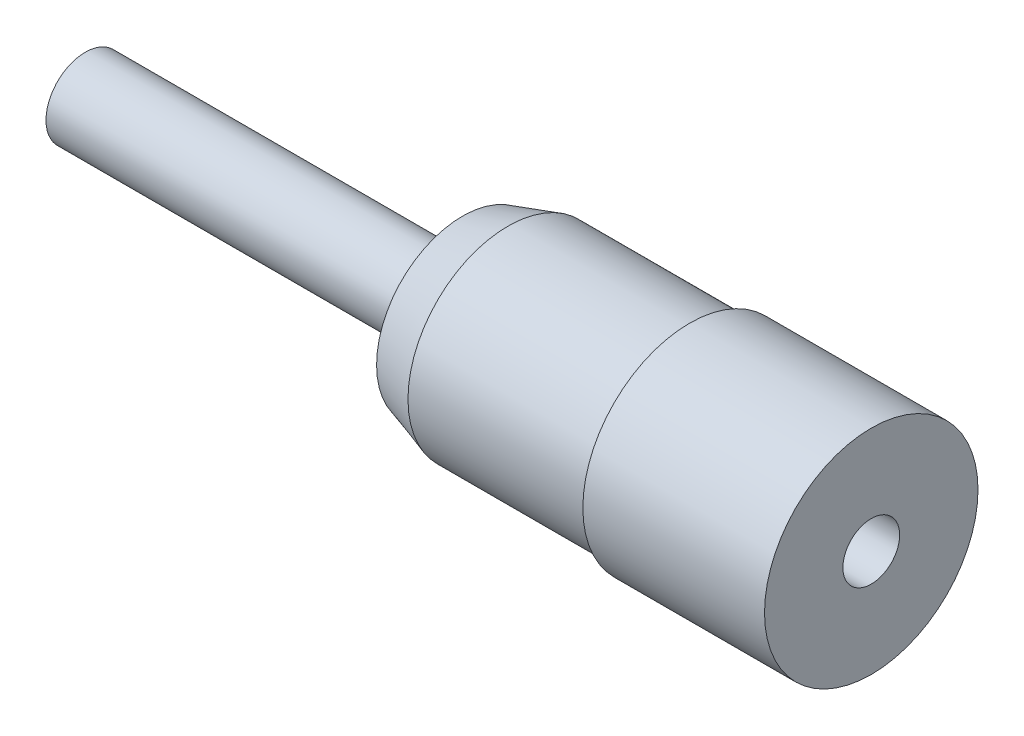
ISO-10303-21;
HEADER;
FILE_DESCRIPTION(('STEP AP214'),'2;1');
FILE_NAME('part.step','',(''),(''),'','','');
FILE_SCHEMA(('AUTOMOTIVE_DESIGN { 1 0 10303 214 1 1 1 1 }'));
ENDSEC;
DATA;
#1=APPLICATION_CONTEXT('core data for automotive mechanical design processes');
#2=APPLICATION_PROTOCOL_DEFINITION('international standard','automotive_design',2000,#1);
#3=PRODUCT_CONTEXT('',#1,'mechanical');
#4=PRODUCT('Part','Part','',(#3));
#5=PRODUCT_RELATED_PRODUCT_CATEGORY('part','',(#4));
#6=PRODUCT_DEFINITION_FORMATION('','',#4);
#7=PRODUCT_DEFINITION_CONTEXT('part definition',#1,'design');
#8=PRODUCT_DEFINITION('design','',#6,#7);
#9=PRODUCT_DEFINITION_SHAPE('','',#8);
#10=(LENGTH_UNIT() NAMED_UNIT(*) SI_UNIT(.MILLI.,.METRE.));
#11=(NAMED_UNIT(*) PLANE_ANGLE_UNIT() SI_UNIT($,.RADIAN.));
#12=(NAMED_UNIT(*) SI_UNIT($,.STERADIAN.) SOLID_ANGLE_UNIT());
#13=UNCERTAINTY_MEASURE_WITH_UNIT(LENGTH_MEASURE(1.E-05),#10,'distance_accuracy_value','');
#14=(GEOMETRIC_REPRESENTATION_CONTEXT(3) GLOBAL_UNCERTAINTY_ASSIGNED_CONTEXT((#13)) GLOBAL_UNIT_ASSIGNED_CONTEXT((#10,
#11,#12)) REPRESENTATION_CONTEXT('',''));
#15=CARTESIAN_POINT('',(0.,0.,0.));
#16=DIRECTION('',(0.,0.,1.));
#17=DIRECTION('',(1.,0.,0.));
#18=AXIS2_PLACEMENT_3D('',#15,#16,#17);
#19=CARTESIAN_POINT('',(277.446915198027,0.,0.));
#20=DIRECTION('',(-1.,0.,0.));
#21=DIRECTION('',(0.,0.,1.));
#22=AXIS2_PLACEMENT_3D('',#19,#20,#21);
#23=PLANE('',#22);
#24=CARTESIAN_POINT('',(277.446915198027,76.7068519283227,0.));
#25=DIRECTION('',(-1.,0.,0.));
#26=DIRECTION('',(0.,0.,1.));
#27=AXIS2_PLACEMENT_3D('',#24,#25,#26);
#28=CIRCLE('',#27,1.73);
#29=CARTESIAN_POINT('',(277.446915198027,76.7068519283227,1.73));
#30=VERTEX_POINT('',#29);
#31=EDGE_CURVE('E55',#30,#30,#28,.T.);
#32=ORIENTED_EDGE('',*,*,#31,.T.);
#33=EDGE_LOOP('',(#32));
#34=FACE_BOUND('',#33,.T.);
#35=ADVANCED_FACE('F36',(#34),#23,.T.);
#36=CARTESIAN_POINT('',(312.055680528163,0.,0.));
#37=DIRECTION('',(1.,0.,0.));
#38=DIRECTION('',(0.,0.,-1.));
#39=AXIS2_PLACEMENT_3D('',#36,#37,#38);
#40=PLANE('',#39);
#41=CARTESIAN_POINT('',(312.055680528163,76.7068519283227,0.));
#42=DIRECTION('',(1.,0.,0.));
#43=DIRECTION('',(0.,0.,-1.));
#44=AXIS2_PLACEMENT_3D('',#41,#42,#43);
#45=CIRCLE('',#44,1.25);
#46=CARTESIAN_POINT('',(312.055680528163,76.7068519283227,-1.25));
#47=VERTEX_POINT('',#46);
#48=EDGE_CURVE('E56',#47,#47,#45,.T.);
#49=ORIENTED_EDGE('',*,*,#48,.F.);
#50=EDGE_LOOP('',(#49));
#51=FACE_BOUND('',#50,.T.);
#52=CARTESIAN_POINT('',(312.055680528163,76.7068519283227,0.));
#53=DIRECTION('',(-1.,0.,0.));
#54=DIRECTION('',(0.,0.,1.));
#55=AXIS2_PLACEMENT_3D('',#52,#53,#54);
#56=CIRCLE('',#55,4.7);
#57=CARTESIAN_POINT('',(312.055680528163,76.7068519283227,4.7));
#58=VERTEX_POINT('',#57);
#59=EDGE_CURVE('E11',#58,#58,#56,.T.);
#60=ORIENTED_EDGE('',*,*,#59,.F.);
#61=EDGE_LOOP('',(#60));
#62=FACE_BOUND('',#61,.T.);
#63=ADVANCED_FACE('F97',(#51,#62),#40,.T.);
#64=CARTESIAN_POINT('',(277.446915198027,76.7068519283227,0.));
#65=DIRECTION('',(-1.,0.,0.));
#66=DIRECTION('',(0.,0.,1.));
#67=AXIS2_PLACEMENT_3D('',#64,#65,#66);
#68=CYLINDRICAL_SURFACE('',#67,4.70000000000001);
#69=ORIENTED_EDGE('',*,*,#59,.T.);
#70=EDGE_LOOP('',(#69));
#71=FACE_BOUND('',#70,.T.);
#72=CARTESIAN_POINT('',(304.055680528163,76.7068519283227,0.));
#73=DIRECTION('',(-1.,0.,0.));
#74=DIRECTION('',(0.,0.,1.));
#75=AXIS2_PLACEMENT_3D('',#72,#73,#74);
#76=CIRCLE('',#75,4.70000000000002);
#77=CARTESIAN_POINT('',(304.055680528163,76.7068519283227,4.70000000000002));
#78=VERTEX_POINT('',#77);
#79=EDGE_CURVE('E42',#78,#78,#76,.T.);
#80=ORIENTED_EDGE('',*,*,#79,.F.);
#81=EDGE_LOOP('',(#80));
#82=FACE_BOUND('',#81,.T.);
#83=ADVANCED_FACE('F95',(#71,#82),#68,.T.);
#84=CARTESIAN_POINT('',(303.855680528163,76.7068519283227,0.));
#85=DIRECTION('',(1.,0.,0.));
#86=DIRECTION('',(0.,0.,-1.));
#87=AXIS2_PLACEMENT_3D('',#84,#85,#86);
#88=CONICAL_SURFACE('',#87,4.4,0.982793723247414);
#89=ORIENTED_EDGE('',*,*,#79,.T.);
#90=EDGE_LOOP('',(#89));
#91=FACE_BOUND('',#90,.T.);
#92=CARTESIAN_POINT('',(303.855680528163,76.7068519283227,0.));
#93=DIRECTION('',(-1.,0.,0.));
#94=DIRECTION('',(0.,0.,1.));
#95=AXIS2_PLACEMENT_3D('',#92,#93,#94);
#96=CIRCLE('',#95,4.4);
#97=CARTESIAN_POINT('',(303.855680528163,76.7068519283227,4.4));
#98=VERTEX_POINT('',#97);
#99=EDGE_CURVE('E87',#98,#98,#96,.T.);
#100=ORIENTED_EDGE('',*,*,#99,.F.);
#101=EDGE_LOOP('',(#100));
#102=FACE_BOUND('',#101,.T.);
#103=ADVANCED_FACE('F92',(#91,#102),#88,.T.);
#104=CARTESIAN_POINT('',(277.446915198027,76.7068519283227,0.));
#105=DIRECTION('',(-1.,0.,0.));
#106=DIRECTION('',(0.,0.,1.));
#107=AXIS2_PLACEMENT_3D('',#104,#105,#106);
#108=CYLINDRICAL_SURFACE('',#107,4.4);
#109=ORIENTED_EDGE('',*,*,#99,.T.);
#110=EDGE_LOOP('',(#109));
#111=FACE_BOUND('',#110,.T.);
#112=CARTESIAN_POINT('',(296.055680528163,76.7068519283227,0.));
#113=DIRECTION('',(-1.,0.,0.));
#114=DIRECTION('',(0.,0.,1.));
#115=AXIS2_PLACEMENT_3D('',#112,#113,#114);
#116=CIRCLE('',#115,4.4);
#117=CARTESIAN_POINT('',(296.055680528163,76.7068519283227,4.4));
#118=VERTEX_POINT('',#117);
#119=EDGE_CURVE('E84',#118,#118,#116,.T.);
#120=ORIENTED_EDGE('',*,*,#119,.F.);
#121=EDGE_LOOP('',(#120));
#122=FACE_BOUND('',#121,.T.);
#123=ADVANCED_FACE('F104',(#111,#122),#108,.T.);
#124=CARTESIAN_POINT('',(296.055680528163,76.7068519283227,0.));
#125=DIRECTION('',(1.,0.,0.));
#126=DIRECTION('',(0.,0.,-1.));
#127=AXIS2_PLACEMENT_3D('',#124,#125,#126);
#128=CONICAL_SURFACE('',#127,4.4,0.29973289233041);
#129=CARTESIAN_POINT('',(294.055680528163,76.7068519283227,0.));
#130=DIRECTION('',(-1.,0.,0.));
#131=DIRECTION('',(0.,0.,1.));
#132=AXIS2_PLACEMENT_3D('',#129,#130,#131);
#133=CIRCLE('',#132,3.78191278626036);
#134=CARTESIAN_POINT('',(294.055680528163,76.7068519283227,3.78191278626036));
#135=VERTEX_POINT('',#134);
#136=EDGE_CURVE('E81',#135,#135,#133,.T.);
#137=ORIENTED_EDGE('',*,*,#136,.F.);
#138=EDGE_LOOP('',(#137));
#139=FACE_BOUND('',#138,.T.);
#140=ORIENTED_EDGE('',*,*,#119,.T.);
#141=EDGE_LOOP('',(#140));
#142=FACE_BOUND('',#141,.T.);
#143=ADVANCED_FACE('F143',(#139,#142),#128,.T.);
#144=CARTESIAN_POINT('',(294.055680528163,0.,0.));
#145=DIRECTION('',(1.,0.,0.));
#146=DIRECTION('',(0.,0.,-1.));
#147=AXIS2_PLACEMENT_3D('',#144,#145,#146);
#148=PLANE('',#147);
#149=CARTESIAN_POINT('',(294.055680528163,76.7068519283227,0.));
#150=DIRECTION('',(-1.,0.,0.));
#151=DIRECTION('',(0.,0.,1.));
#152=AXIS2_PLACEMENT_3D('',#149,#150,#151);
#153=CIRCLE('',#152,3.46791323915042);
#154=CARTESIAN_POINT('',(294.055680528163,76.7068519283227,3.46791323915042));
#155=VERTEX_POINT('',#154);
#156=EDGE_CURVE('E78',#155,#155,#153,.T.);
#157=ORIENTED_EDGE('',*,*,#156,.F.);
#158=EDGE_LOOP('',(#157));
#159=FACE_BOUND('',#158,.T.);
#160=ORIENTED_EDGE('',*,*,#136,.T.);
#161=EDGE_LOOP('',(#160));
#162=FACE_BOUND('',#161,.T.);
#163=ADVANCED_FACE('F139',(#159,#162),#148,.F.);
#164=CARTESIAN_POINT('',(296.100980113072,76.7068519283227,0.));
#165=DIRECTION('',(1.,0.,0.));
#166=DIRECTION('',(0.,0.,-1.));
#167=AXIS2_PLACEMENT_3D('',#164,#165,#166);
#168=CONICAL_SURFACE('',#167,4.10000000000001,0.299732892330405);
#169=ORIENTED_EDGE('',*,*,#156,.T.);
#170=EDGE_LOOP('',(#169));
#171=FACE_BOUND('',#170,.T.);
#172=CARTESIAN_POINT('',(296.100980113072,76.7068519283227,0.));
#173=DIRECTION('',(-1.,0.,0.));
#174=DIRECTION('',(0.,0.,1.));
#175=AXIS2_PLACEMENT_3D('',#172,#173,#174);
#176=CIRCLE('',#175,4.10000000000001);
#177=CARTESIAN_POINT('',(296.100980113072,76.7068519283227,4.10000000000001));
#178=VERTEX_POINT('',#177);
#179=EDGE_CURVE('E75',#178,#178,#176,.T.);
#180=ORIENTED_EDGE('',*,*,#179,.F.);
#181=EDGE_LOOP('',(#180));
#182=FACE_BOUND('',#181,.T.);
#183=ADVANCED_FACE('F135',(#171,#182),#168,.F.);
#184=CARTESIAN_POINT('',(277.446915198027,76.7068519283227,0.));
#185=DIRECTION('',(-1.,0.,0.));
#186=DIRECTION('',(0.,0.,1.));
#187=AXIS2_PLACEMENT_3D('',#184,#185,#186);
#188=CYLINDRICAL_SURFACE('',#187,4.10000000000001);
#189=CARTESIAN_POINT('',(304.01623565571,76.7068519283227,0.));
#190=DIRECTION('',(-1.,0.,0.));
#191=DIRECTION('',(0.,0.,1.));
#192=AXIS2_PLACEMENT_3D('',#189,#190,#191);
#193=CIRCLE('',#192,4.10000000000001);
#194=CARTESIAN_POINT('',(304.01623565571,76.7068519283227,4.10000000000001));
#195=VERTEX_POINT('',#194);
#196=EDGE_CURVE('E72',#195,#195,#193,.T.);
#197=ORIENTED_EDGE('',*,*,#196,.F.);
#198=EDGE_LOOP('',(#197));
#199=FACE_BOUND('',#198,.T.);
#200=ORIENTED_EDGE('',*,*,#179,.T.);
#201=EDGE_LOOP('',(#200));
#202=FACE_BOUND('',#201,.T.);
#203=ADVANCED_FACE('F131',(#199,#202),#188,.F.);
#204=CARTESIAN_POINT('',(304.01623565571,76.7068519283227,0.));
#205=DIRECTION('',(1.,0.,0.));
#206=DIRECTION('',(0.,0.,-1.));
#207=AXIS2_PLACEMENT_3D('',#204,#205,#206);
#208=CONICAL_SURFACE('',#207,4.10000000000001,0.982793723247372);
#209=CARTESIAN_POINT('',(304.21623565571,76.7068519283227,0.));
#210=DIRECTION('',(-1.,0.,0.));
#211=DIRECTION('',(0.,0.,1.));
#212=AXIS2_PLACEMENT_3D('',#209,#210,#211);
#213=CIRCLE('',#212,4.4);
#214=CARTESIAN_POINT('',(304.21623565571,76.7068519283227,4.4));
#215=VERTEX_POINT('',#214);
#216=EDGE_CURVE('E69',#215,#215,#213,.T.);
#217=ORIENTED_EDGE('',*,*,#216,.F.);
#218=EDGE_LOOP('',(#217));
#219=FACE_BOUND('',#218,.T.);
#220=ORIENTED_EDGE('',*,*,#196,.T.);
#221=EDGE_LOOP('',(#220));
#222=FACE_BOUND('',#221,.T.);
#223=ADVANCED_FACE('F127',(#219,#222),#208,.F.);
#224=CARTESIAN_POINT('',(277.446915198027,76.7068519283227,0.));
#225=DIRECTION('',(-1.,0.,0.));
#226=DIRECTION('',(0.,0.,1.));
#227=AXIS2_PLACEMENT_3D('',#224,#225,#226);
#228=CYLINDRICAL_SURFACE('',#227,4.40000000000001);
#229=CARTESIAN_POINT('',(309.446915198027,76.7068519283227,0.));
#230=DIRECTION('',(-1.,0.,0.));
#231=DIRECTION('',(0.,0.,1.));
#232=AXIS2_PLACEMENT_3D('',#229,#230,#231);
#233=CIRCLE('',#232,4.40000000000001);
#234=CARTESIAN_POINT('',(309.446915198027,76.7068519283227,4.40000000000001));
#235=VERTEX_POINT('',#234);
#236=EDGE_CURVE('E66',#235,#235,#233,.T.);
#237=ORIENTED_EDGE('',*,*,#236,.F.);
#238=EDGE_LOOP('',(#237));
#239=FACE_BOUND('',#238,.T.);
#240=ORIENTED_EDGE('',*,*,#216,.T.);
#241=EDGE_LOOP('',(#240));
#242=FACE_BOUND('',#241,.T.);
#243=ADVANCED_FACE('F120',(#239,#242),#228,.F.);
#244=CARTESIAN_POINT('',(309.446915198027,0.,0.));
#245=DIRECTION('',(-1.,0.,0.));
#246=DIRECTION('',(0.,0.,1.));
#247=AXIS2_PLACEMENT_3D('',#244,#245,#246);
#248=PLANE('',#247);
#249=ORIENTED_EDGE('',*,*,#236,.T.);
#250=EDGE_LOOP('',(#249));
#251=FACE_BOUND('',#250,.T.);
#252=CARTESIAN_POINT('',(309.446915198027,76.7068519283227,0.));
#253=DIRECTION('',(-1.,0.,0.));
#254=DIRECTION('',(0.,0.,1.));
#255=AXIS2_PLACEMENT_3D('',#252,#253,#254);
#256=CIRCLE('',#255,1.73);
#257=CARTESIAN_POINT('',(309.446915198027,76.7068519283227,1.73));
#258=VERTEX_POINT('',#257);
#259=EDGE_CURVE('E59',#258,#258,#256,.T.);
#260=ORIENTED_EDGE('',*,*,#259,.F.);
#261=EDGE_LOOP('',(#260));
#262=FACE_BOUND('',#261,.T.);
#263=ADVANCED_FACE('F114',(#251,#262),#248,.T.);
#264=CARTESIAN_POINT('',(277.446915198027,76.7068519283227,0.));
#265=DIRECTION('',(-1.,0.,0.));
#266=DIRECTION('',(0.,0.,1.));
#267=AXIS2_PLACEMENT_3D('',#264,#265,#266);
#268=CYLINDRICAL_SURFACE('',#267,1.73);
#269=ORIENTED_EDGE('',*,*,#259,.T.);
#270=EDGE_LOOP('',(#269));
#271=FACE_BOUND('',#270,.T.);
#272=ORIENTED_EDGE('',*,*,#31,.F.);
#273=EDGE_LOOP('',(#272));
#274=FACE_BOUND('',#273,.T.);
#275=ADVANCED_FACE('F49',(#271,#274),#268,.T.);
#276=CARTESIAN_POINT('',(306.555680528163,76.7068519283227,0.));
#277=DIRECTION('',(1.,0.,0.));
#278=DIRECTION('',(0.,0.,-1.));
#279=AXIS2_PLACEMENT_3D('',#276,#277,#278);
#280=CONICAL_SURFACE('',#279,1.25,1.02974425867668);
#281=CARTESIAN_POINT('',(305.804604754379,76.7068519283227,0.));
#282=VERTEX_POINT('',#281);
#283=VERTEX_LOOP('',#282);
#284=FACE_BOUND('',#283,.T.);
#285=CARTESIAN_POINT('',(306.555680528163,76.7068519283227,0.));
#286=DIRECTION('',(1.,0.,0.));
#287=DIRECTION('',(0.,0.,-1.));
#288=AXIS2_PLACEMENT_3D('',#285,#286,#287);
#289=CIRCLE('',#288,1.25);
#290=CARTESIAN_POINT('',(306.555680528163,76.7068519283227,-1.25));
#291=VERTEX_POINT('',#290);
#292=EDGE_CURVE('E53',#291,#291,#289,.T.);
#293=ORIENTED_EDGE('',*,*,#292,.T.);
#294=EDGE_LOOP('',(#293));
#295=FACE_BOUND('',#294,.T.);
#296=ADVANCED_FACE('F45',(#284,#295),#280,.F.);
#297=CARTESIAN_POINT('',(312.055680528163,76.7068519283227,0.));
#298=DIRECTION('',(1.,0.,0.));
#299=DIRECTION('',(0.,0.,-1.));
#300=AXIS2_PLACEMENT_3D('',#297,#298,#299);
#301=CYLINDRICAL_SURFACE('',#300,1.25);
#302=ORIENTED_EDGE('',*,*,#292,.F.);
#303=EDGE_LOOP('',(#302));
#304=FACE_BOUND('',#303,.T.);
#305=ORIENTED_EDGE('',*,*,#48,.T.);
#306=EDGE_LOOP('',(#305));
#307=FACE_BOUND('',#306,.T.);
#308=ADVANCED_FACE('F48',(#304,#307),#301,.F.);
#309=CLOSED_SHELL('',(#35,#63,#83,#103,#123,#143,#163,#183,#203,#223,#243,#263,#275,#296,#308));
#310=MANIFOLD_SOLID_BREP('B2',#309);
#311=ADVANCED_BREP_SHAPE_REPRESENTATION('',(#18,#310),#14);
#312=SHAPE_DEFINITION_REPRESENTATION(#9,#311);
ENDSEC;
END-ISO-10303-21;
